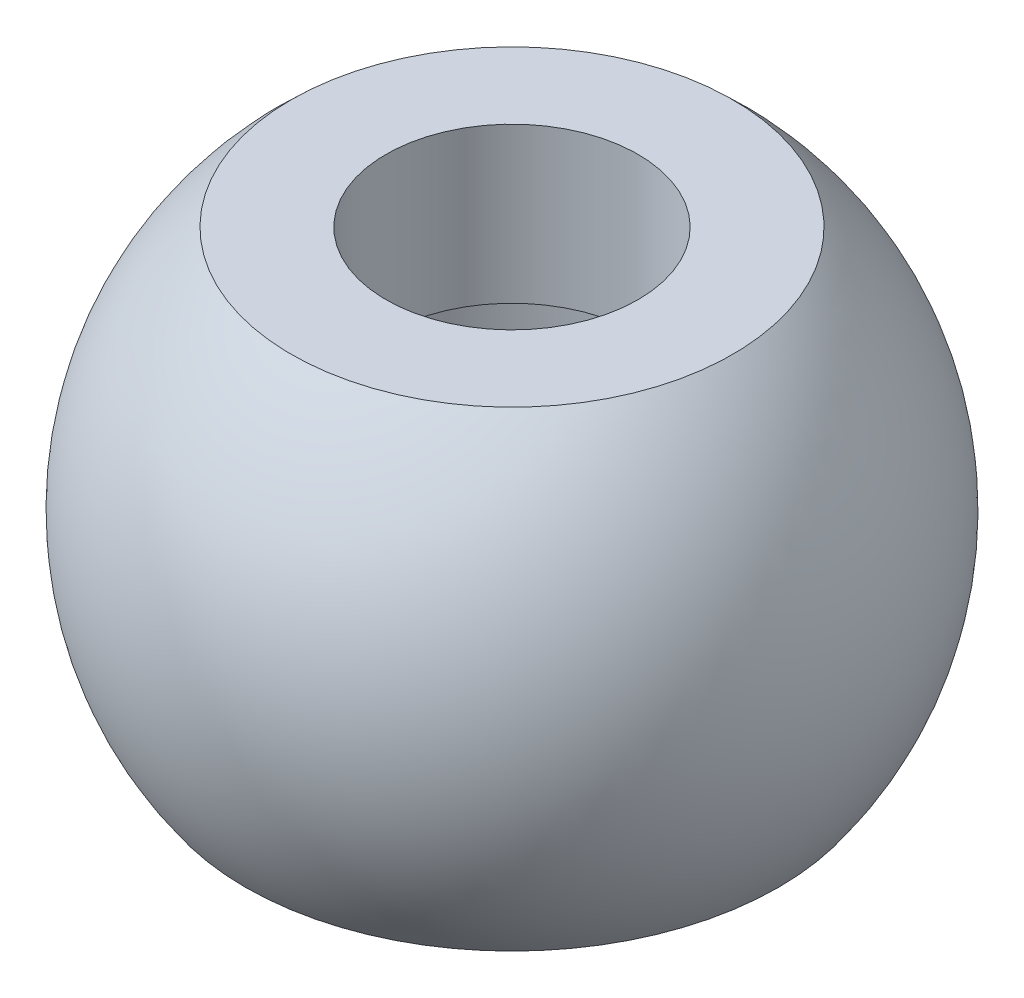
ISO-10303-21;
HEADER;
FILE_DESCRIPTION(('STEP AP214'),'2;1');
FILE_NAME('part.step','',(''),(''),'','','');
FILE_SCHEMA(('AUTOMOTIVE_DESIGN { 1 0 10303 214 1 1 1 1 }'));
ENDSEC;
DATA;
#1=APPLICATION_CONTEXT('core data for automotive mechanical design processes');
#2=APPLICATION_PROTOCOL_DEFINITION('international standard','automotive_design',2000,#1);
#3=PRODUCT_CONTEXT('',#1,'mechanical');
#4=PRODUCT('Part','Part','',(#3));
#5=PRODUCT_RELATED_PRODUCT_CATEGORY('part','',(#4));
#6=PRODUCT_DEFINITION_FORMATION('','',#4);
#7=PRODUCT_DEFINITION_CONTEXT('part definition',#1,'design');
#8=PRODUCT_DEFINITION('design','',#6,#7);
#9=PRODUCT_DEFINITION_SHAPE('','',#8);
#10=(LENGTH_UNIT() NAMED_UNIT(*) SI_UNIT(.MILLI.,.METRE.));
#11=(NAMED_UNIT(*) PLANE_ANGLE_UNIT() SI_UNIT($,.RADIAN.));
#12=(NAMED_UNIT(*) SI_UNIT($,.STERADIAN.) SOLID_ANGLE_UNIT());
#13=UNCERTAINTY_MEASURE_WITH_UNIT(LENGTH_MEASURE(1.E-05),#10,'distance_accuracy_value','');
#14=(GEOMETRIC_REPRESENTATION_CONTEXT(3) GLOBAL_UNCERTAINTY_ASSIGNED_CONTEXT((#13)) GLOBAL_UNIT_ASSIGNED_CONTEXT((#10,
#11,#12)) REPRESENTATION_CONTEXT('',''));
#15=CARTESIAN_POINT('',(0.,0.,0.));
#16=DIRECTION('',(0.,0.,1.));
#17=DIRECTION('',(1.,0.,0.));
#18=AXIS2_PLACEMENT_3D('',#15,#16,#17);
#19=CARTESIAN_POINT('',(0.,16.0357584258483,0.));
#20=DIRECTION('',(0.,1.,0.));
#21=DIRECTION('',(-1.,0.,0.));
#22=AXIS2_PLACEMENT_3D('',#19,#20,#21);
#23=PLANE('',#22);
#24=CARTESIAN_POINT('',(0.,16.0357584258483,0.));
#25=DIRECTION('',(0.,-1.,0.));
#26=DIRECTION('',(1.,0.,0.));
#27=AXIS2_PLACEMENT_3D('',#24,#25,#26);
#28=CIRCLE('',#27,8.25499999999994);
#29=CARTESIAN_POINT('',(8.25499999999989,16.0357584258483,0.));
#30=VERTEX_POINT('',#29);
#31=EDGE_CURVE('E64',#30,#30,#28,.T.);
#32=ORIENTED_EDGE('',*,*,#31,.T.);
#33=EDGE_LOOP('',(#32));
#34=FACE_BOUND('',#33,.T.);
#35=CARTESIAN_POINT('',(0.,16.0357584258483,0.));
#36=DIRECTION('',(0.,-1.,0.));
#37=DIRECTION('',(1.,0.,0.));
#38=AXIS2_PLACEMENT_3D('',#35,#36,#37);
#39=CIRCLE('',#38,14.4562288204024);
#40=CARTESIAN_POINT('',(-14.4562288204025,16.0357584258483,0.));
#41=VERTEX_POINT('',#40);
#42=EDGE_CURVE('E48',#41,#41,#39,.T.);
#43=ORIENTED_EDGE('',*,*,#42,.F.);
#44=EDGE_LOOP('',(#43));
#45=FACE_BOUND('',#44,.T.);
#46=ADVANCED_FACE('F41',(#34,#45),#23,.T.);
#47=CARTESIAN_POINT('',(0.,0.,0.));
#48=DIRECTION('',(0.,-1.,0.));
#49=DIRECTION('',(-1.,0.,0.));
#50=AXIS2_PLACEMENT_3D('',#47,#48,#49);
#51=SPHERICAL_SURFACE('',#50,21.59);
#52=CARTESIAN_POINT('',(0.,-12.6999999999999,0.));
#53=DIRECTION('',(0.,-1.,0.));
#54=DIRECTION('',(1.,0.,0.));
#55=AXIS2_PLACEMENT_3D('',#52,#53,#54);
#56=CIRCLE('',#55,17.4596133977818);
#57=CARTESIAN_POINT('',(-17.4596133977817,-12.7,0.));
#58=VERTEX_POINT('',#57);
#59=EDGE_CURVE('E53',#58,#58,#56,.T.);
#60=CARTESIAN_POINT('',(-17.4596133977817,-12.7,0.));
#61=CARTESIAN_POINT('',(-17.6535614714112,-12.4333751486851,0.));
#62=CARTESIAN_POINT('',(-17.8413926806473,-12.1623014916021,0.));
#63=CARTESIAN_POINT('',(-18.2044480717705,-11.6118391753353,0.));
#64=CARTESIAN_POINT('',(-18.3796722536576,-11.3324505161514,0.));
#65=CARTESIAN_POINT('',(-18.7171402915202,-10.7659408051175,0.));
#66=CARTESIAN_POINT('',(-18.8793841474958,-10.4788197532675,0.));
#67=CARTESIAN_POINT('',(-19.1905525629947,-9.89744876820739,0.));
#68=CARTESIAN_POINT('',(-19.3394771225181,-9.60319883499724,0.));
#69=CARTESIAN_POINT('',(-19.6236940256601,-9.00818730569015,0.));
#70=CARTESIAN_POINT('',(-19.7589863692788,-8.70742570959321,0.));
#71=CARTESIAN_POINT('',(-20.0156550373058,-8.10002207338693,0.));
#72=CARTESIAN_POINT('',(-20.1370313617142,-7.79338003327759,0.));
#73=CARTESIAN_POINT('',(-20.3656132543949,-7.1748589780815,0.));
#74=CARTESIAN_POINT('',(-20.4728188226672,-6.86297996299476,0.));
#75=CARTESIAN_POINT('',(-20.6728342400101,-6.234639440767,0.));
#76=CARTESIAN_POINT('',(-20.7656440890807,-5.91817793362599,0.));
#77=CARTESIAN_POINT('',(-20.9366733045672,-5.28133652011044,0.));
#78=CARTESIAN_POINT('',(-21.014892670983,-4.96095661373589,0.));
#79=CARTESIAN_POINT('',(-21.1565767784448,-4.31695071906161,0.));
#80=CARTESIAN_POINT('',(-21.2200415194908,-3.99332473076187,0.));
#81=CARTESIAN_POINT('',(-21.332083195363,-3.34350580098187,0.));
#82=CARTESIAN_POINT('',(-21.3806601301892,-3.01731285950159,0.));
#83=CARTESIAN_POINT('',(-21.4628242550079,-2.36304453897833,0.));
#84=CARTESIAN_POINT('',(-21.4964114450004,-2.03496915993533,0.));
#85=CARTESIAN_POINT('',(-21.5485255974534,-1.37762443016466,0.));
#86=CARTESIAN_POINT('',(-21.5670525599139,-1.04835507943699,0.));
#87=CARTESIAN_POINT('',(-21.5890073784918,-0.38931337773241,0.));
#88=CARTESIAN_POINT('',(-21.5924352346092,-0.059541026755511,0.));
#89=CARTESIAN_POINT('',(-21.5841846471472,0.599814648468879,0.));
#90=CARTESIAN_POINT('',(-21.5725062035678,0.92939797271637,0.));
#91=CARTESIAN_POINT('',(-21.5340675239157,1.58768396417509,0.));
#92=CARTESIAN_POINT('',(-21.507307287843,1.91638663138632,0.));
#93=CARTESIAN_POINT('',(-21.4387611795353,2.57222152652382,0.));
#94=CARTESIAN_POINT('',(-21.3969753073002,2.89935375445009,0.));
#95=CARTESIAN_POINT('',(-21.2984656142829,3.55136128433439,0.));
#96=CARTESIAN_POINT('',(-21.2417417935006,3.87623658629242,0.));
#97=CARTESIAN_POINT('',(-21.113475238275,4.52304851371384,0.));
#98=CARTESIAN_POINT('',(-21.0419325038316,4.84498513917724,0.));
#99=CARTESIAN_POINT('',(-20.8841782536478,5.4852441298938,0.));
#100=CARTESIAN_POINT('',(-20.7979667379073,5.80356649514696,0.));
#101=CARTESIAN_POINT('',(-20.6110558399143,6.43592896624611,0.));
#102=CARTESIAN_POINT('',(-20.5103564576618,6.7499690720921,0.));
#103=CARTESIAN_POINT('',(-20.294681144216,7.373108011509,0.));
#104=CARTESIAN_POINT('',(-20.1797052130227,7.6822068450799,0.));
#105=CARTESIAN_POINT('',(-19.935718078549,8.29481459629106,0.));
#106=CARTESIAN_POINT('',(-19.8067068752686,8.59832351393132,0.));
#107=CARTESIAN_POINT('',(-19.5349199266388,9.19911452021966,0.));
#108=CARTESIAN_POINT('',(-19.3921441812893,9.49639660886774,0.));
#109=CARTESIAN_POINT('',(-19.0931277628266,10.0841101105062,0.));
#110=CARTESIAN_POINT('',(-18.9368870897132,10.3745415234965,0.));
#111=CARTESIAN_POINT('',(-18.6112686883756,10.947944205526,0.));
#112=CARTESIAN_POINT('',(-18.4418909601513,11.2309154745652,0.));
#113=CARTESIAN_POINT('',(-18.0903538810986,11.7888040471615,0.));
#114=CARTESIAN_POINT('',(-17.9081945302702,12.0637213507185,0.));
#115=CARTESIAN_POINT('',(-17.5314764915076,12.6049251031946,0.));
#116=CARTESIAN_POINT('',(-17.3369178035734,12.8712115521137,0.));
#117=CARTESIAN_POINT('',(-16.9358092812673,13.3945947017979,0.));
#118=CARTESIAN_POINT('',(-16.7292594468953,13.6516914025631,0.));
#119=CARTESIAN_POINT('',(-16.3046024143355,14.1561558807689,0.));
#120=CARTESIAN_POINT('',(-16.0864952161477,14.4035236582095,0.));
#121=CARTESIAN_POINT('',(-15.6391798923476,14.8880099122644,0.));
#122=CARTESIAN_POINT('',(-15.4099717667353,15.1251283888787,0.));
#123=CARTESIAN_POINT('',(-14.9409402886117,15.5886232121321,0.));
#124=CARTESIAN_POINT('',(-14.7011169361005,15.8149995587712,0.));
#125=CARTESIAN_POINT('',(-14.4562288204025,16.0357584258483,0.));
#126=B_SPLINE_CURVE_WITH_KNOTS('',3,(#60,#61,#62,#63,#64,#65,#66,#67,#68,#69,#70,#71,#72,#73,
#74,#75,#76,#77,#78,#79,#80,#81,#82,#83,#84,#85,#86,#87,#88,#89,#90,#91,#92,#93,#94,#95,#96,#97,
#98,#99,#100,#101,#102,#103,#104,#105,#106,#107,#108,#109,#110,#111,#112,#113,#114,#115,#116,
#117,#118,#119,#120,#121,#122,#123,#124,#125),.UNSPECIFIED.,.F.,.F.,(4,2,2,2,2,2,2,2,2,2,2,2,2,
2,2,2,2,2,2,2,2,2,2,2,2,2,2,2,2,2,2,2,4),(0.,0.989024466164218,1.97804893232843,
2.96707339849265,3.95609786465687,4.94512233082109,5.93414679698531,6.92317126314953,
7.91219572931374,8.90122019547796,9.89024466164218,10.8792691278064,11.8682935939706,
12.8573180601348,13.8463425262991,14.8353669924633,15.8243914586275,16.8134159247917,
17.8024403909559,18.7914648571201,19.7804893232844,20.7695137894486,21.7585382556128,
22.747562721777,23.7365871879412,24.7256116541055,25.7146361202697,26.7036605864339,
27.6926850525981,28.6817095187623,29.6707339849265,30.6597584510908,31.648782917255),.UNSPECIFIED.);
#127=EDGE_CURVE('BSEAM85',#58,#41,#126,.T.);
#128=ORIENTED_EDGE('',*,*,#59,.F.);
#129=ORIENTED_EDGE('',*,*,#42,.T.);
#130=ORIENTED_EDGE('',*,*,#127,.T.);
#131=ORIENTED_EDGE('',*,*,#127,.F.);
#132=EDGE_LOOP('',(#128,#130,#129,#131));
#133=FACE_BOUND('',#132,.T.);
#134=ADVANCED_FACE('F85',(#133),#51,.T.);
#135=CARTESIAN_POINT('',(0.,-12.6999999999999,0.));
#136=DIRECTION('',(0.,-1.,0.));
#137=DIRECTION('',(1.,0.,0.));
#138=AXIS2_PLACEMENT_3D('',#135,#136,#137);
#139=PLANE('',#138);
#140=ORIENTED_EDGE('',*,*,#59,.T.);
#141=EDGE_LOOP('',(#140));
#142=FACE_BOUND('',#141,.T.);
#143=CARTESIAN_POINT('',(0.,-12.7,0.));
#144=DIRECTION('',(0.,-1.,0.));
#145=DIRECTION('',(1.,0.,0.));
#146=AXIS2_PLACEMENT_3D('',#143,#144,#145);
#147=CIRCLE('',#146,11.43);
#148=CARTESIAN_POINT('',(11.4300000000001,-12.6999999999999,0.));
#149=VERTEX_POINT('',#148);
#150=EDGE_CURVE('E58',#149,#149,#147,.T.);
#151=ORIENTED_EDGE('',*,*,#150,.F.);
#152=EDGE_LOOP('',(#151));
#153=FACE_BOUND('',#152,.T.);
#154=ADVANCED_FACE('F90',(#142,#153),#139,.T.);
#155=CARTESIAN_POINT('',(0.,0.,0.));
#156=DIRECTION('',(0.,-1.,0.));
#157=DIRECTION('',(1.,0.,0.));
#158=AXIS2_PLACEMENT_3D('',#155,#156,#157);
#159=CYLINDRICAL_SURFACE('',#158,11.43);
#160=CARTESIAN_POINT('',(0.,5.87575842584833,0.));
#161=DIRECTION('',(0.,-1.,0.));
#162=DIRECTION('',(1.,0.,0.));
#163=AXIS2_PLACEMENT_3D('',#160,#161,#162);
#164=CIRCLE('',#163,11.43);
#165=CARTESIAN_POINT('',(11.43,5.87575842584836,0.));
#166=VERTEX_POINT('',#165);
#167=EDGE_CURVE('E10',#166,#166,#164,.T.);
#168=ORIENTED_EDGE('',*,*,#167,.F.);
#169=EDGE_LOOP('',(#168));
#170=FACE_BOUND('',#169,.T.);
#171=ORIENTED_EDGE('',*,*,#150,.T.);
#172=EDGE_LOOP('',(#171));
#173=FACE_BOUND('',#172,.T.);
#174=ADVANCED_FACE('F81',(#170,#173),#159,.F.);
#175=CARTESIAN_POINT('',(0.,0.,0.));
#176=DIRECTION('',(0.,-1.,0.));
#177=DIRECTION('',(1.,0.,0.));
#178=AXIS2_PLACEMENT_3D('',#175,#176,#177);
#179=CYLINDRICAL_SURFACE('',#178,8.25499999999996);
#180=ORIENTED_EDGE('',*,*,#31,.F.);
#181=EDGE_LOOP('',(#180));
#182=FACE_BOUND('',#181,.T.);
#183=CARTESIAN_POINT('',(0.,5.87575842584833,0.));
#184=DIRECTION('',(0.,-1.,0.));
#185=DIRECTION('',(1.,0.,0.));
#186=AXIS2_PLACEMENT_3D('',#183,#184,#185);
#187=CIRCLE('',#186,8.255);
#188=CARTESIAN_POINT('',(8.25499999999998,5.87575842584835,0.));
#189=VERTEX_POINT('',#188);
#190=EDGE_CURVE('E68',#189,#189,#187,.T.);
#191=ORIENTED_EDGE('',*,*,#190,.T.);
#192=EDGE_LOOP('',(#191));
#193=FACE_BOUND('',#192,.T.);
#194=ADVANCED_FACE('F73',(#182,#193),#179,.F.);
#195=CARTESIAN_POINT('',(0.,5.87575842584833,0.));
#196=DIRECTION('',(0.,-1.,0.));
#197=DIRECTION('',(1.,0.,0.));
#198=AXIS2_PLACEMENT_3D('',#195,#196,#197);
#199=PLANE('',#198);
#200=ORIENTED_EDGE('',*,*,#167,.T.);
#201=EDGE_LOOP('',(#200));
#202=FACE_BOUND('',#201,.T.);
#203=ORIENTED_EDGE('',*,*,#190,.F.);
#204=EDGE_LOOP('',(#203));
#205=FACE_BOUND('',#204,.T.);
#206=ADVANCED_FACE('F75',(#202,#205),#199,.T.);
#207=CLOSED_SHELL('',(#46,#134,#154,#174,#194,#206));
#208=MANIFOLD_SOLID_BREP('B2',#207);
#209=ADVANCED_BREP_SHAPE_REPRESENTATION('',(#18,#208),#14);
#210=SHAPE_DEFINITION_REPRESENTATION(#9,#209);
ENDSEC;
END-ISO-10303-21;
